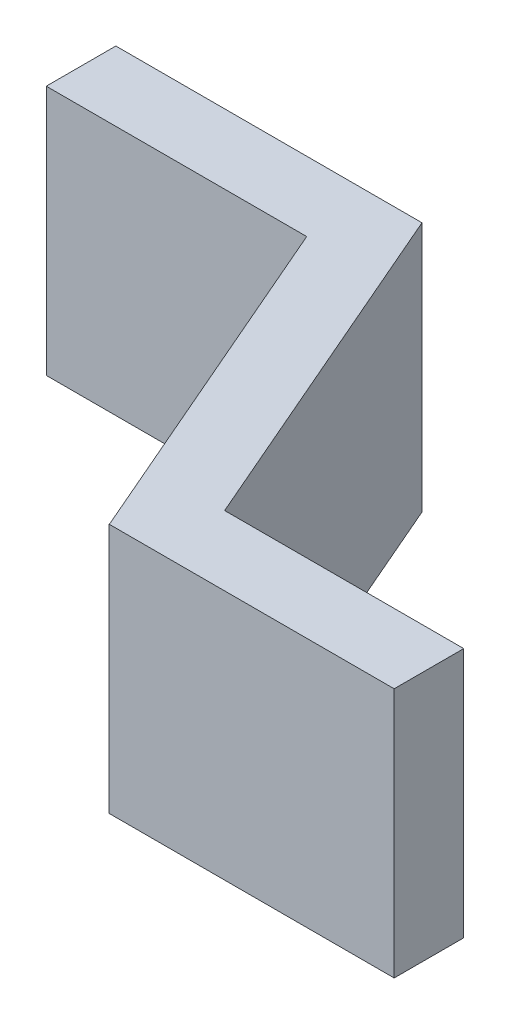
ISO-10303-21;
HEADER;
FILE_DESCRIPTION(('STEP AP214'),'2;1');
FILE_NAME('part.step','',(''),(''),'','','');
FILE_SCHEMA(('AUTOMOTIVE_DESIGN { 1 0 10303 214 1 1 1 1 }'));
ENDSEC;
DATA;
#1=APPLICATION_CONTEXT('core data for automotive mechanical design processes');
#2=APPLICATION_PROTOCOL_DEFINITION('international standard','automotive_design',2000,#1);
#3=PRODUCT_CONTEXT('',#1,'mechanical');
#4=PRODUCT('Part','Part','',(#3));
#5=PRODUCT_RELATED_PRODUCT_CATEGORY('part','',(#4));
#6=PRODUCT_DEFINITION_FORMATION('','',#4);
#7=PRODUCT_DEFINITION_CONTEXT('part definition',#1,'design');
#8=PRODUCT_DEFINITION('design','',#6,#7);
#9=PRODUCT_DEFINITION_SHAPE('','',#8);
#10=(LENGTH_UNIT() NAMED_UNIT(*) SI_UNIT(.MILLI.,.METRE.));
#11=(NAMED_UNIT(*) PLANE_ANGLE_UNIT() SI_UNIT($,.RADIAN.));
#12=(NAMED_UNIT(*) SI_UNIT($,.STERADIAN.) SOLID_ANGLE_UNIT());
#13=UNCERTAINTY_MEASURE_WITH_UNIT(LENGTH_MEASURE(1.E-05),#10,'distance_accuracy_value','');
#14=(GEOMETRIC_REPRESENTATION_CONTEXT(3) GLOBAL_UNCERTAINTY_ASSIGNED_CONTEXT((#13)) GLOBAL_UNIT_ASSIGNED_CONTEXT((#10,
#11,#12)) REPRESENTATION_CONTEXT('',''));
#15=CARTESIAN_POINT('',(0.,0.,0.));
#16=DIRECTION('',(0.,0.,1.));
#17=DIRECTION('',(1.,0.,0.));
#18=AXIS2_PLACEMENT_3D('',#15,#16,#17);
#19=CARTESIAN_POINT('',(0.,9.02,0.));
#20=DIRECTION('',(1.,0.,0.));
#21=DIRECTION('',(0.,0.,-1.));
#22=AXIS2_PLACEMENT_3D('',#19,#20,#21);
#23=PLANE('',#22);
#24=DIRECTION('',(0.,1.,0.));
#25=VECTOR('',#24,1.);
#26=CARTESIAN_POINT('',(0.,9.02,0.));
#27=LINE('',#26,#25);
#28=CARTESIAN_POINT('',(0.,9.380000014305,-1.30339419427667E-10));
#29=VERTEX_POINT('',#28);
#30=CARTESIAN_POINT('',(0.,9.02,-1.556831963824E-10));
#31=VERTEX_POINT('',#30);
#32=EDGE_CURVE('E123',#29,#31,#27,.F.);
#33=ORIENTED_EDGE('',*,*,#32,.T.);
#34=DIRECTION('',(0.,0.,1.));
#35=VECTOR('',#34,1.);
#36=CARTESIAN_POINT('',(0.,9.02,0.));
#37=LINE('',#36,#35);
#38=CARTESIAN_POINT('',(0.,9.02,0.10000000149));
#39=VERTEX_POINT('',#38);
#40=EDGE_CURVE('E115',#31,#39,#37,.T.);
#41=ORIENTED_EDGE('',*,*,#40,.T.);
#42=DIRECTION('',(0.,1.,0.));
#43=VECTOR('',#42,1.);
#44=CARTESIAN_POINT('',(0.,9.02,0.10000000149));
#45=LINE('',#44,#43);
#46=CARTESIAN_POINT('',(0.,9.380000014305,0.10000000149));
#47=VERTEX_POINT('',#46);
#48=EDGE_CURVE('E134',#47,#39,#45,.F.);
#49=ORIENTED_EDGE('',*,*,#48,.F.);
#50=DIRECTION('',(0.,0.,1.));
#51=VECTOR('',#50,1.);
#52=CARTESIAN_POINT('',(0.,9.380000014305,0.));
#53=LINE('',#52,#51);
#54=EDGE_CURVE('E140',#29,#47,#53,.T.);
#55=ORIENTED_EDGE('',*,*,#54,.F.);
#56=EDGE_LOOP('',(#33,#41,#49,#55));
#57=FACE_BOUND('',#56,.T.);
#58=ADVANCED_FACE('F17',(#57),#23,.F.);
#59=CARTESIAN_POINT('',(0.,9.02,0.10000000149));
#60=DIRECTION('',(0.,0.,1.));
#61=DIRECTION('',(1.,0.,0.));
#62=AXIS2_PLACEMENT_3D('',#59,#60,#61);
#63=PLANE('',#62);
#64=DIRECTION('',(0.,1.,0.));
#65=VECTOR('',#64,1.);
#66=CARTESIAN_POINT('',(0.374312226605181,9.02,0.100000001489922));
#67=LINE('',#66,#65);
#68=CARTESIAN_POINT('',(0.37431222660506,9.380000014305,0.100000001489974));
#69=VERTEX_POINT('',#68);
#70=CARTESIAN_POINT('',(0.374312226605091,9.02,0.100000001489974));
#71=VERTEX_POINT('',#70);
#72=EDGE_CURVE('E132',#69,#71,#67,.F.);
#73=ORIENTED_EDGE('',*,*,#72,.F.);
#74=DIRECTION('',(1.,0.,0.));
#75=VECTOR('',#74,1.);
#76=CARTESIAN_POINT('',(0.44,9.380000014305,0.10000000149));
#77=LINE('',#76,#75);
#78=EDGE_CURVE('E137',#47,#69,#77,.T.);
#79=ORIENTED_EDGE('',*,*,#78,.F.);
#80=ORIENTED_EDGE('',*,*,#48,.T.);
#81=DIRECTION('',(1.,0.,0.));
#82=VECTOR('',#81,1.);
#83=CARTESIAN_POINT('',(0.44,9.02,0.10000000149));
#84=LINE('',#83,#82);
#85=EDGE_CURVE('E111',#39,#71,#84,.T.);
#86=ORIENTED_EDGE('',*,*,#85,.T.);
#87=EDGE_LOOP('',(#73,#79,#80,#86));
#88=FACE_BOUND('',#87,.T.);
#89=ADVANCED_FACE('F214',(#88),#63,.T.);
#90=CARTESIAN_POINT('',(0.348224508223,9.02,0.03971472531736));
#91=DIRECTION('',(-0.917754904098641,0.,0.397147247255844));
#92=DIRECTION('',(0.397147247255844,0.,0.917754904098641));
#93=AXIS2_PLACEMENT_3D('',#90,#91,#92);
#94=PLANE('',#93);
#95=DIRECTION('',(0.397147247255413,0.,0.917754904098827));
#96=VECTOR('',#95,1.);
#97=CARTESIAN_POINT('',(0.374312226605,9.02,0.10000000149));
#98=LINE('',#97,#96);
#99=CARTESIAN_POINT('',(0.59,9.02,0.59842599627));
#100=VERTEX_POINT('',#99);
#101=EDGE_CURVE('E110',#71,#100,#98,.T.);
#102=ORIENTED_EDGE('',*,*,#101,.T.);
#103=DIRECTION('',(0.,1.,0.));
#104=VECTOR('',#103,1.);
#105=CARTESIAN_POINT('',(0.59,9.02,0.59842599627));
#106=LINE('',#105,#104);
#107=CARTESIAN_POINT('',(0.59,9.380000014305,0.59842599627));
#108=VERTEX_POINT('',#107);
#109=EDGE_CURVE('E86',#100,#108,#106,.T.);
#110=ORIENTED_EDGE('',*,*,#109,.T.);
#111=DIRECTION('',(0.397147247255413,0.,0.917754904098827));
#112=VECTOR('',#111,1.);
#113=CARTESIAN_POINT('',(0.374312226605,9.380000014305,0.10000000149));
#114=LINE('',#113,#112);
#115=EDGE_CURVE('E139',#69,#108,#114,.T.);
#116=ORIENTED_EDGE('',*,*,#115,.F.);
#117=ORIENTED_EDGE('',*,*,#72,.T.);
#118=EDGE_LOOP('',(#102,#110,#116,#117));
#119=FACE_BOUND('',#118,.T.);
#120=ADVANCED_FACE('F215',(#119),#94,.T.);
#121=CARTESIAN_POINT('',(0.59,9.02,0.5));
#122=DIRECTION('',(1.,0.,0.));
#123=DIRECTION('',(0.,0.,-1.));
#124=AXIS2_PLACEMENT_3D('',#121,#122,#123);
#125=PLANE('',#124);
#126=ORIENTED_EDGE('',*,*,#109,.F.);
#127=DIRECTION('',(0.,0.,-1.));
#128=VECTOR('',#127,1.);
#129=CARTESIAN_POINT('',(0.59,9.02,0.5));
#130=LINE('',#129,#128);
#131=CARTESIAN_POINT('',(0.59,9.02,0.60000000149));
#132=VERTEX_POINT('',#131);
#133=EDGE_CURVE('E20',#100,#132,#130,.F.);
#134=ORIENTED_EDGE('',*,*,#133,.T.);
#135=DIRECTION('',(0.,1.,0.));
#136=VECTOR('',#135,1.);
#137=CARTESIAN_POINT('',(0.59,9.02,0.60000000149));
#138=LINE('',#137,#136);
#139=CARTESIAN_POINT('',(0.59,9.380000014305,0.60000000149));
#140=VERTEX_POINT('',#139);
#141=EDGE_CURVE('E93',#140,#132,#138,.F.);
#142=ORIENTED_EDGE('',*,*,#141,.F.);
#143=DIRECTION('',(0.,0.,1.));
#144=VECTOR('',#143,1.);
#145=CARTESIAN_POINT('',(0.59,9.380000014305,0.));
#146=LINE('',#145,#144);
#147=EDGE_CURVE('E182',#108,#140,#146,.T.);
#148=ORIENTED_EDGE('',*,*,#147,.F.);
#149=EDGE_LOOP('',(#126,#134,#142,#148));
#150=FACE_BOUND('',#149,.T.);
#151=ADVANCED_FACE('F109',(#150),#125,.F.);
#152=CARTESIAN_POINT('',(0.59,9.02,0.60000000149));
#153=DIRECTION('',(0.,0.,1.));
#154=DIRECTION('',(1.,0.,0.));
#155=AXIS2_PLACEMENT_3D('',#152,#153,#154);
#156=PLANE('',#155);
#157=ORIENTED_EDGE('',*,*,#141,.T.);
#158=DIRECTION('',(1.,0.,0.));
#159=VECTOR('',#158,1.);
#160=CARTESIAN_POINT('',(0.44,9.02,0.60000000149));
#161=LINE('',#160,#159);
#162=CARTESIAN_POINT('',(0.999999996424,9.02,0.60000000149));
#163=VERTEX_POINT('',#162);
#164=EDGE_CURVE('E97',#132,#163,#161,.T.);
#165=ORIENTED_EDGE('',*,*,#164,.T.);
#166=DIRECTION('',(0.,1.,0.));
#167=VECTOR('',#166,1.);
#168=CARTESIAN_POINT('',(0.999999996424,9.02,0.60000000149));
#169=LINE('',#168,#167);
#170=CARTESIAN_POINT('',(0.999999996424,9.380000014305,0.60000000149));
#171=VERTEX_POINT('',#170);
#172=EDGE_CURVE('E99',#171,#163,#169,.F.);
#173=ORIENTED_EDGE('',*,*,#172,.F.);
#174=DIRECTION('',(1.,0.,0.));
#175=VECTOR('',#174,1.);
#176=CARTESIAN_POINT('',(0.44,9.380000014305,0.60000000149));
#177=LINE('',#176,#175);
#178=EDGE_CURVE('E98',#140,#171,#177,.T.);
#179=ORIENTED_EDGE('',*,*,#178,.F.);
#180=EDGE_LOOP('',(#157,#165,#173,#179));
#181=FACE_BOUND('',#180,.T.);
#182=ADVANCED_FACE('F95',(#181),#156,.T.);
#183=CARTESIAN_POINT('',(0.999999996424,9.02,0.5));
#184=DIRECTION('',(1.,0.,0.));
#185=DIRECTION('',(0.,0.,-1.));
#186=AXIS2_PLACEMENT_3D('',#183,#184,#185);
#187=PLANE('',#186);
#188=DIRECTION('',(0.,0.,1.));
#189=VECTOR('',#188,1.);
#190=CARTESIAN_POINT('',(0.999999996424,9.02,0.));
#191=LINE('',#190,#189);
#192=CARTESIAN_POINT('',(0.999999996424,9.02,0.5));
#193=VERTEX_POINT('',#192);
#194=EDGE_CURVE('E107',#163,#193,#191,.F.);
#195=ORIENTED_EDGE('',*,*,#194,.T.);
#196=DIRECTION('',(0.,1.,0.));
#197=VECTOR('',#196,1.);
#198=CARTESIAN_POINT('',(0.999999996424,9.02,0.5));
#199=LINE('',#198,#197);
#200=CARTESIAN_POINT('',(0.999999996424,9.380000014305,0.5));
#201=VERTEX_POINT('',#200);
#202=EDGE_CURVE('E192',#193,#201,#199,.T.);
#203=ORIENTED_EDGE('',*,*,#202,.T.);
#204=DIRECTION('',(0.,0.,1.));
#205=VECTOR('',#204,1.);
#206=CARTESIAN_POINT('',(0.999999996424,9.380000014305,0.));
#207=LINE('',#206,#205);
#208=EDGE_CURVE('E126',#171,#201,#207,.F.);
#209=ORIENTED_EDGE('',*,*,#208,.F.);
#210=ORIENTED_EDGE('',*,*,#172,.T.);
#211=EDGE_LOOP('',(#195,#203,#209,#210));
#212=FACE_BOUND('',#211,.T.);
#213=ADVANCED_FACE('F238',(#212),#187,.T.);
#214=CARTESIAN_POINT('',(0.,9.02,0.));
#215=DIRECTION('',(0.,0.,1.));
#216=DIRECTION('',(1.,0.,0.));
#217=AXIS2_PLACEMENT_3D('',#214,#215,#216);
#218=PLANE('',#217);
#219=DIRECTION('',(1.,0.,0.));
#220=VECTOR('',#219,1.);
#221=CARTESIAN_POINT('',(0.44,9.02,-2.335247945736E-10));
#222=LINE('',#221,#220);
#223=CARTESIAN_POINT('',(0.439999999656335,9.02,-3.43069646239979E-10));
#224=VERTEX_POINT('',#223);
#225=EDGE_CURVE('E155',#224,#31,#222,.F.);
#226=ORIENTED_EDGE('',*,*,#225,.T.);
#227=ORIENTED_EDGE('',*,*,#32,.F.);
#228=DIRECTION('',(1.,0.,0.));
#229=VECTOR('',#228,1.);
#230=CARTESIAN_POINT('',(0.44,9.380000014305,-1.955091291415E-10));
#231=LINE('',#230,#229);
#232=CARTESIAN_POINT('',(0.439999999458534,9.380000014305,-1.955091291415E-10));
#233=VERTEX_POINT('',#232);
#234=EDGE_CURVE('E147',#233,#29,#231,.F.);
#235=ORIENTED_EDGE('',*,*,#234,.F.);
#236=DIRECTION('',(0.,1.,0.));
#237=VECTOR('',#236,1.);
#238=CARTESIAN_POINT('',(0.439999999804137,9.02,-4.52614497906357E-10));
#239=LINE('',#238,#237);
#240=EDGE_CURVE('E128',#233,#224,#239,.F.);
#241=ORIENTED_EDGE('',*,*,#240,.T.);
#242=EDGE_LOOP('',(#226,#227,#235,#241));
#243=FACE_BOUND('',#242,.T.);
#244=ADVANCED_FACE('F235',(#243),#218,.F.);
#245=CARTESIAN_POINT('',(0.44,9.02,0.));
#246=DIRECTION('',(0.,1.,0.));
#247=DIRECTION('',(0.,0.,1.));
#248=AXIS2_PLACEMENT_3D('',#245,#246,#247);
#249=PLANE('',#248);
#250=DIRECTION('',(1.,0.,0.));
#251=VECTOR('',#250,1.);
#252=CARTESIAN_POINT('',(0.59,9.02,0.5));
#253=LINE('',#252,#251);
#254=CARTESIAN_POINT('',(0.656368904967001,9.02,0.499999999999999));
#255=VERTEX_POINT('',#254);
#256=EDGE_CURVE('E166',#255,#193,#253,.T.);
#257=ORIENTED_EDGE('',*,*,#256,.T.);
#258=ORIENTED_EDGE('',*,*,#194,.F.);
#259=ORIENTED_EDGE('',*,*,#164,.F.);
#260=ORIENTED_EDGE('',*,*,#133,.F.);
#261=ORIENTED_EDGE('',*,*,#101,.F.);
#262=ORIENTED_EDGE('',*,*,#85,.F.);
#263=ORIENTED_EDGE('',*,*,#40,.F.);
#264=ORIENTED_EDGE('',*,*,#225,.F.);
#265=DIRECTION('',(0.397147247255844,0.,0.917754904098641));
#266=VECTOR('',#265,1.);
#267=CARTESIAN_POINT('',(0.44,9.02,0.));
#268=LINE('',#267,#266);
#269=EDGE_CURVE('E160',#224,#255,#268,.T.);
#270=ORIENTED_EDGE('',*,*,#269,.T.);
#271=EDGE_LOOP('',(#257,#258,#259,#260,#261,#262,#263,#264,#270));
#272=FACE_BOUND('',#271,.T.);
#273=ADVANCED_FACE('F104',(#272),#249,.F.);
#274=CARTESIAN_POINT('',(0.59,9.02,0.5));
#275=DIRECTION('',(0.,0.,1.));
#276=DIRECTION('',(1.,0.,0.));
#277=AXIS2_PLACEMENT_3D('',#274,#275,#276);
#278=PLANE('',#277);
#279=ORIENTED_EDGE('',*,*,#256,.F.);
#280=DIRECTION('',(0.,1.,0.));
#281=VECTOR('',#280,1.);
#282=CARTESIAN_POINT('',(0.656368904967005,9.02,0.499999999999998));
#283=LINE('',#282,#281);
#284=CARTESIAN_POINT('',(0.656368904967001,9.380000014305,0.499999999999999));
#285=VERTEX_POINT('',#284);
#286=EDGE_CURVE('E26',#255,#285,#283,.T.);
#287=ORIENTED_EDGE('',*,*,#286,.T.);
#288=DIRECTION('',(1.,0.,0.));
#289=VECTOR('',#288,1.);
#290=CARTESIAN_POINT('',(0.44,9.380000014305,0.5));
#291=LINE('',#290,#289);
#292=EDGE_CURVE('E34',#201,#285,#291,.F.);
#293=ORIENTED_EDGE('',*,*,#292,.F.);
#294=ORIENTED_EDGE('',*,*,#202,.F.);
#295=EDGE_LOOP('',(#279,#287,#293,#294));
#296=FACE_BOUND('',#295,.T.);
#297=ADVANCED_FACE('F199',(#296),#278,.F.);
#298=CARTESIAN_POINT('',(0.44,9.380000014305,0.));
#299=DIRECTION('',(0.,1.,0.));
#300=DIRECTION('',(0.,0.,1.));
#301=AXIS2_PLACEMENT_3D('',#298,#299,#300);
#302=PLANE('',#301);
#303=ORIENTED_EDGE('',*,*,#178,.T.);
#304=ORIENTED_EDGE('',*,*,#208,.T.);
#305=ORIENTED_EDGE('',*,*,#292,.T.);
#306=DIRECTION('',(0.397147247255844,0.,0.917754904098641));
#307=VECTOR('',#306,1.);
#308=CARTESIAN_POINT('',(0.44,9.380000014305,0.));
#309=LINE('',#308,#307);
#310=EDGE_CURVE('E11',#285,#233,#309,.F.);
#311=ORIENTED_EDGE('',*,*,#310,.T.);
#312=ORIENTED_EDGE('',*,*,#234,.T.);
#313=ORIENTED_EDGE('',*,*,#54,.T.);
#314=ORIENTED_EDGE('',*,*,#78,.T.);
#315=ORIENTED_EDGE('',*,*,#115,.T.);
#316=ORIENTED_EDGE('',*,*,#147,.T.);
#317=EDGE_LOOP('',(#303,#304,#305,#311,#312,#313,#314,#315,#316));
#318=FACE_BOUND('',#317,.T.);
#319=ADVANCED_FACE('F204',(#318),#302,.T.);
#320=CARTESIAN_POINT('',(0.44,9.02,0.));
#321=DIRECTION('',(-0.917754904098641,0.,0.397147247255844));
#322=DIRECTION('',(0.397147247255844,0.,0.917754904098641));
#323=AXIS2_PLACEMENT_3D('',#320,#321,#322);
#324=PLANE('',#323);
#325=ORIENTED_EDGE('',*,*,#286,.F.);
#326=ORIENTED_EDGE('',*,*,#269,.F.);
#327=ORIENTED_EDGE('',*,*,#240,.F.);
#328=ORIENTED_EDGE('',*,*,#310,.F.);
#329=EDGE_LOOP('',(#325,#326,#327,#328));
#330=FACE_BOUND('',#329,.T.);
#331=ADVANCED_FACE('F201',(#330),#324,.F.);
#332=CLOSED_SHELL('',(#58,#89,#120,#151,#182,#213,#244,#273,#297,#319,#331));
#333=MANIFOLD_SOLID_BREP('B1',#332);
#334=ADVANCED_BREP_SHAPE_REPRESENTATION('',(#18,#333),#14);
#335=SHAPE_DEFINITION_REPRESENTATION(#9,#334);
ENDSEC;
END-ISO-10303-21;
